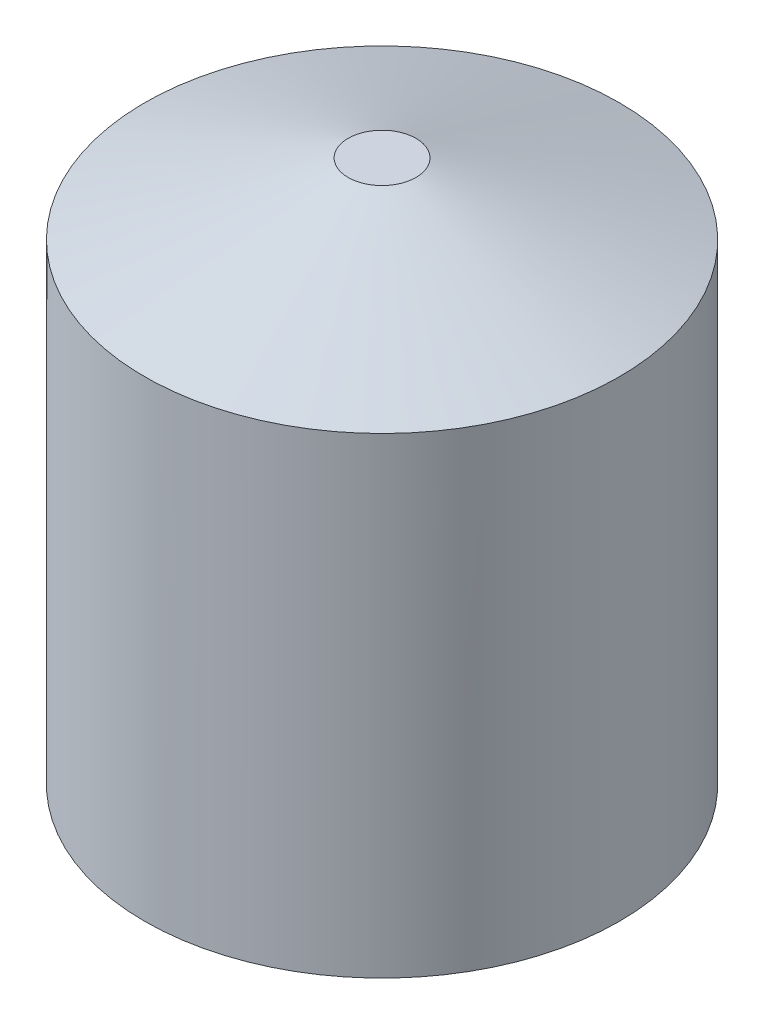
ISO-10303-21;
HEADER;
FILE_DESCRIPTION(('STEP AP214'),'2;1');
FILE_NAME('part.step','',(''),(''),'','','');
FILE_SCHEMA(('AUTOMOTIVE_DESIGN { 1 0 10303 214 1 1 1 1 }'));
ENDSEC;
DATA;
#1=APPLICATION_CONTEXT('core data for automotive mechanical design processes');
#2=APPLICATION_PROTOCOL_DEFINITION('international standard','automotive_design',2000,#1);
#3=PRODUCT_CONTEXT('',#1,'mechanical');
#4=PRODUCT('Part','Part','',(#3));
#5=PRODUCT_RELATED_PRODUCT_CATEGORY('part','',(#4));
#6=PRODUCT_DEFINITION_FORMATION('','',#4);
#7=PRODUCT_DEFINITION_CONTEXT('part definition',#1,'design');
#8=PRODUCT_DEFINITION('design','',#6,#7);
#9=PRODUCT_DEFINITION_SHAPE('','',#8);
#10=(LENGTH_UNIT() NAMED_UNIT(*) SI_UNIT(.MILLI.,.METRE.));
#11=(NAMED_UNIT(*) PLANE_ANGLE_UNIT() SI_UNIT($,.RADIAN.));
#12=(NAMED_UNIT(*) SI_UNIT($,.STERADIAN.) SOLID_ANGLE_UNIT());
#13=UNCERTAINTY_MEASURE_WITH_UNIT(LENGTH_MEASURE(1.E-05),#10,'distance_accuracy_value','');
#14=(GEOMETRIC_REPRESENTATION_CONTEXT(3) GLOBAL_UNCERTAINTY_ASSIGNED_CONTEXT((#13)) GLOBAL_UNIT_ASSIGNED_CONTEXT((#10,
#11,#12)) REPRESENTATION_CONTEXT('',''));
#15=CARTESIAN_POINT('',(0.,0.,0.));
#16=DIRECTION('',(0.,0.,1.));
#17=DIRECTION('',(1.,0.,0.));
#18=AXIS2_PLACEMENT_3D('',#15,#16,#17);
#19=CARTESIAN_POINT('',(0.,3200.,0.));
#20=DIRECTION('',(0.,-1.,0.));
#21=DIRECTION('',(0.,0.,-1.));
#22=AXIS2_PLACEMENT_3D('',#19,#20,#21);
#23=CYLINDRICAL_SURFACE('',#22,1400.);
#24=CARTESIAN_POINT('',(0.,0.,0.));
#25=DIRECTION('',(0.,1.,0.));
#26=DIRECTION('',(0.,0.,1.));
#27=AXIS2_PLACEMENT_3D('',#24,#25,#26);
#28=CIRCLE('',#27,1400.);
#29=CARTESIAN_POINT('',(0.,0.,1400.));
#30=VERTEX_POINT('',#29);
#31=EDGE_CURVE('E10',#30,#30,#28,.T.);
#32=ORIENTED_EDGE('',*,*,#31,.T.);
#33=EDGE_LOOP('',(#32));
#34=FACE_BOUND('',#33,.T.);
#35=CARTESIAN_POINT('',(0.,2782.05809219406,0.));
#36=DIRECTION('',(0.,-1.,0.));
#37=DIRECTION('',(0.,0.,-1.));
#38=AXIS2_PLACEMENT_3D('',#35,#36,#37);
#39=CIRCLE('',#38,1400.);
#40=CARTESIAN_POINT('',(0.,2782.05809219406,-1400.));
#41=VERTEX_POINT('',#40);
#42=EDGE_CURVE('E41',#41,#41,#39,.F.);
#43=ORIENTED_EDGE('',*,*,#42,.F.);
#44=EDGE_LOOP('',(#43));
#45=FACE_BOUND('',#44,.T.);
#46=ADVANCED_FACE('F35',(#34,#45),#23,.T.);
#47=CARTESIAN_POINT('',(0.,0.,0.));
#48=DIRECTION('',(0.,1.,0.));
#49=DIRECTION('',(0.,0.,1.));
#50=AXIS2_PLACEMENT_3D('',#47,#48,#49);
#51=PLANE('',#50);
#52=ORIENTED_EDGE('',*,*,#31,.F.);
#53=EDGE_LOOP('',(#52));
#54=FACE_BOUND('',#53,.T.);
#55=ADVANCED_FACE('F56',(#54),#51,.F.);
#56=CARTESIAN_POINT('',(0.,3200.,0.));
#57=DIRECTION('',(0.,-1.,0.));
#58=DIRECTION('',(0.,0.,-1.));
#59=AXIS2_PLACEMENT_3D('',#56,#57,#58);
#60=CONICAL_SURFACE('',#59,200.,1.23565023181822);
#61=CARTESIAN_POINT('',(0.,3200.,0.));
#62=DIRECTION('',(0.,1.,0.));
#63=DIRECTION('',(0.,0.,1.));
#64=AXIS2_PLACEMENT_3D('',#61,#62,#63);
#65=CIRCLE('',#64,200.);
#66=CARTESIAN_POINT('',(0.,3200.,200.));
#67=VERTEX_POINT('',#66);
#68=EDGE_CURVE('E45',#67,#67,#65,.T.);
#69=ORIENTED_EDGE('',*,*,#68,.F.);
#70=EDGE_LOOP('',(#69));
#71=FACE_BOUND('',#70,.T.);
#72=ORIENTED_EDGE('',*,*,#42,.T.);
#73=EDGE_LOOP('',(#72));
#74=FACE_BOUND('',#73,.T.);
#75=ADVANCED_FACE('F54',(#71,#74),#60,.T.);
#76=CARTESIAN_POINT('',(0.,3200.,0.));
#77=DIRECTION('',(0.,1.,0.));
#78=DIRECTION('',(0.,0.,1.));
#79=AXIS2_PLACEMENT_3D('',#76,#77,#78);
#80=PLANE('',#79);
#81=ORIENTED_EDGE('',*,*,#68,.T.);
#82=EDGE_LOOP('',(#81));
#83=FACE_BOUND('',#82,.T.);
#84=ADVANCED_FACE('F52',(#83),#80,.T.);
#85=CLOSED_SHELL('',(#46,#55,#75,#84));
#86=MANIFOLD_SOLID_BREP('B2',#85);
#87=ADVANCED_BREP_SHAPE_REPRESENTATION('',(#18,#86),#14);
#88=SHAPE_DEFINITION_REPRESENTATION(#9,#87);
ENDSEC;
END-ISO-10303-21;
